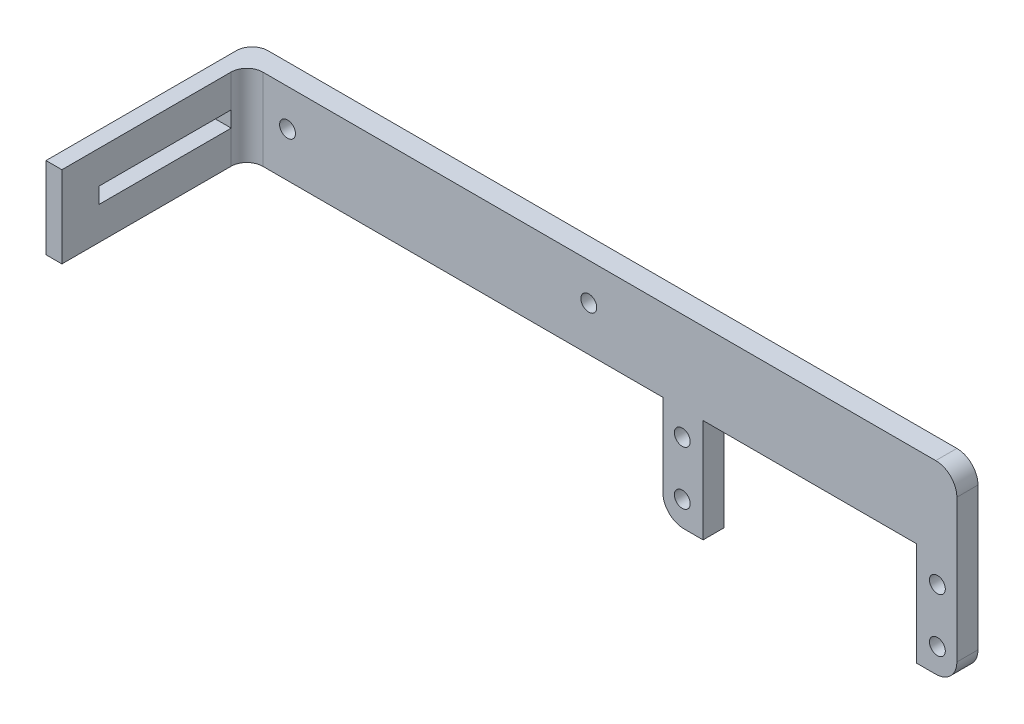
ISO-10303-21;
HEADER;
FILE_DESCRIPTION(('STEP AP214'),'2;1');
FILE_NAME('part.step','',(''),(''),'','','');
FILE_SCHEMA(('AUTOMOTIVE_DESIGN { 1 0 10303 214 1 1 1 1 }'));
ENDSEC;
DATA;
#1=APPLICATION_CONTEXT('core data for automotive mechanical design processes');
#2=APPLICATION_PROTOCOL_DEFINITION('international standard','automotive_design',2000,#1);
#3=PRODUCT_CONTEXT('',#1,'mechanical');
#4=PRODUCT('Part','Part','',(#3));
#5=PRODUCT_RELATED_PRODUCT_CATEGORY('part','',(#4));
#6=PRODUCT_DEFINITION_FORMATION('','',#4);
#7=PRODUCT_DEFINITION_CONTEXT('part definition',#1,'design');
#8=PRODUCT_DEFINITION('design','',#6,#7);
#9=PRODUCT_DEFINITION_SHAPE('','',#8);
#10=(LENGTH_UNIT() NAMED_UNIT(*) SI_UNIT(.MILLI.,.METRE.));
#11=(NAMED_UNIT(*) PLANE_ANGLE_UNIT() SI_UNIT($,.RADIAN.));
#12=(NAMED_UNIT(*) SI_UNIT($,.STERADIAN.) SOLID_ANGLE_UNIT());
#13=UNCERTAINTY_MEASURE_WITH_UNIT(LENGTH_MEASURE(1.E-05),#10,'distance_accuracy_value','');
#14=(GEOMETRIC_REPRESENTATION_CONTEXT(3) GLOBAL_UNCERTAINTY_ASSIGNED_CONTEXT((#13)) GLOBAL_UNIT_ASSIGNED_CONTEXT((#10,
#11,#12)) REPRESENTATION_CONTEXT('',''));
#15=CARTESIAN_POINT('',(0.,0.,0.));
#16=DIRECTION('',(0.,0.,1.));
#17=DIRECTION('',(1.,0.,0.));
#18=AXIS2_PLACEMENT_3D('',#15,#16,#17);
#19=CARTESIAN_POINT('',(0.,32.3655253772291,4.));
#20=DIRECTION('',(0.,1.,0.));
#21=DIRECTION('',(0.,0.,1.));
#22=AXIS2_PLACEMENT_3D('',#19,#20,#21);
#23=PLANE('',#22);
#24=DIRECTION('',(1.,0.,0.));
#25=VECTOR('',#24,1.);
#26=CARTESIAN_POINT('',(0.,32.3655253772291,0.));
#27=LINE('',#26,#25);
#28=CARTESIAN_POINT('',(-153.391060609872,32.3655253772291,0.));
#29=VERTEX_POINT('',#28);
#30=CARTESIAN_POINT('',(-23.0750939681456,32.3655253772291,0.));
#31=VERTEX_POINT('',#30);
#32=EDGE_CURVE('E266',#29,#31,#27,.T.);
#33=ORIENTED_EDGE('',*,*,#32,.F.);
#34=CARTESIAN_POINT('',(-153.391060609872,32.3655253772291,3.));
#35=DIRECTION('',(0.,1.,0.));
#36=DIRECTION('',(0.,0.,1.));
#37=AXIS2_PLACEMENT_3D('',#34,#35,#36);
#38=CIRCLE('',#37,3.);
#39=CARTESIAN_POINT('',(-156.391060609872,32.3655253772291,3.));
#40=VERTEX_POINT('',#39);
#41=EDGE_CURVE('E374',#29,#40,#38,.T.);
#42=ORIENTED_EDGE('',*,*,#41,.T.);
#43=DIRECTION('',(0.,0.,-1.));
#44=VECTOR('',#43,1.);
#45=CARTESIAN_POINT('',(-156.391060609872,32.3655253772291,4.));
#46=LINE('',#45,#44);
#47=CARTESIAN_POINT('',(-156.391060609872,32.3655253772291,39.));
#48=VERTEX_POINT('',#47);
#49=EDGE_CURVE('E328',#48,#40,#46,.T.);
#50=ORIENTED_EDGE('',*,*,#49,.F.);
#51=DIRECTION('',(-1.,0.,0.));
#52=VECTOR('',#51,1.);
#53=CARTESIAN_POINT('',(-156.391060609872,32.3655253772291,39.));
#54=LINE('',#53,#52);
#55=CARTESIAN_POINT('',(-153.384544729697,32.3655253772291,39.));
#56=VERTEX_POINT('',#55);
#57=EDGE_CURVE('E224',#56,#48,#54,.T.);
#58=ORIENTED_EDGE('',*,*,#57,.F.);
#59=DIRECTION('',(0.,0.,-1.));
#60=VECTOR('',#59,1.);
#61=CARTESIAN_POINT('',(-153.384544729697,32.3655253772291,39.));
#62=LINE('',#61,#60);
#63=CARTESIAN_POINT('',(-153.384544729697,32.3655253772291,7.));
#64=VERTEX_POINT('',#63);
#65=EDGE_CURVE('E227',#56,#64,#62,.T.);
#66=ORIENTED_EDGE('',*,*,#65,.T.);
#67=CARTESIAN_POINT('',(-150.384544729697,32.3655253772291,7.));
#68=DIRECTION('',(0.,1.,0.));
#69=DIRECTION('',(0.,0.,1.));
#70=AXIS2_PLACEMENT_3D('',#67,#68,#69);
#71=CIRCLE('',#70,3.);
#72=CARTESIAN_POINT('',(-150.384544729697,32.3655253772291,4.));
#73=VERTEX_POINT('',#72);
#74=EDGE_CURVE('E363',#64,#73,#71,.F.);
#75=ORIENTED_EDGE('',*,*,#74,.T.);
#76=DIRECTION('',(1.,0.,0.));
#77=VECTOR('',#76,1.);
#78=CARTESIAN_POINT('',(0.,32.3655253772291,4.));
#79=LINE('',#78,#77);
#80=CARTESIAN_POINT('',(-23.0750939681456,32.3655253772291,4.));
#81=VERTEX_POINT('',#80);
#82=EDGE_CURVE('E269',#73,#81,#79,.T.);
#83=ORIENTED_EDGE('',*,*,#82,.T.);
#84=DIRECTION('',(0.,0.,-1.));
#85=VECTOR('',#84,1.);
#86=CARTESIAN_POINT('',(-23.0750939681456,32.3655253772291,0.));
#87=LINE('',#86,#85);
#88=EDGE_CURVE('E331',#81,#31,#87,.T.);
#89=ORIENTED_EDGE('',*,*,#88,.T.);
#90=EDGE_LOOP('',(#33,#42,#50,#58,#66,#75,#83,#89));
#91=FACE_BOUND('',#90,.T.);
#92=ADVANCED_FACE('F35',(#91),#23,.T.);
#93=CARTESIAN_POINT('',(-156.391060609872,0.,4.));
#94=DIRECTION('',(1.,0.,0.));
#95=DIRECTION('',(0.,0.,-1.));
#96=AXIS2_PLACEMENT_3D('',#93,#94,#95);
#97=PLANE('',#96);
#98=DIRECTION('',(0.,0.,-1.));
#99=VECTOR('',#98,1.);
#100=CARTESIAN_POINT('',(-156.391060609872,23.1655253772291,4.));
#101=LINE('',#100,#99);
#102=CARTESIAN_POINT('',(-156.391060609872,23.1655253772291,31.96699669967));
#103=VERTEX_POINT('',#102);
#104=CARTESIAN_POINT('',(-156.391060609872,23.1655253772291,6.96699669966997));
#105=VERTEX_POINT('',#104);
#106=EDGE_CURVE('E193',#103,#105,#101,.T.);
#107=ORIENTED_EDGE('',*,*,#106,.T.);
#108=DIRECTION('',(0.,1.,0.));
#109=VECTOR('',#108,1.);
#110=CARTESIAN_POINT('',(-156.391060609872,0.,6.96699669966997));
#111=LINE('',#110,#109);
#112=CARTESIAN_POINT('',(-156.391060609872,26.1655253772291,6.96699669966997));
#113=VERTEX_POINT('',#112);
#114=EDGE_CURVE('E212',#105,#113,#111,.T.);
#115=ORIENTED_EDGE('',*,*,#114,.T.);
#116=DIRECTION('',(0.,0.,1.));
#117=VECTOR('',#116,1.);
#118=CARTESIAN_POINT('',(-156.391060609872,26.1655253772291,4.));
#119=LINE('',#118,#117);
#120=CARTESIAN_POINT('',(-156.391060609872,26.1655253772291,31.96699669967));
#121=VERTEX_POINT('',#120);
#122=EDGE_CURVE('E209',#113,#121,#119,.T.);
#123=ORIENTED_EDGE('',*,*,#122,.T.);
#124=DIRECTION('',(0.,-1.,0.));
#125=VECTOR('',#124,1.);
#126=CARTESIAN_POINT('',(-156.391060609872,0.,31.96699669967));
#127=LINE('',#126,#125);
#128=EDGE_CURVE('E215',#121,#103,#127,.T.);
#129=ORIENTED_EDGE('',*,*,#128,.T.);
#130=EDGE_LOOP('',(#107,#115,#123,#129));
#131=FACE_BOUND('',#130,.T.);
#132=ORIENTED_EDGE('',*,*,#49,.T.);
#133=DIRECTION('',(0.,-1.,0.));
#134=VECTOR('',#133,1.);
#135=CARTESIAN_POINT('',(-156.391060609872,0.,3.));
#136=LINE('',#135,#134);
#137=CARTESIAN_POINT('',(-156.391060609872,16.9235253772291,3.));
#138=VERTEX_POINT('',#137);
#139=EDGE_CURVE('E367',#40,#138,#136,.T.);
#140=ORIENTED_EDGE('',*,*,#139,.T.);
#141=DIRECTION('',(0.,0.,-1.));
#142=VECTOR('',#141,1.);
#143=CARTESIAN_POINT('',(-156.391060609872,16.9235253772291,4.));
#144=LINE('',#143,#142);
#145=CARTESIAN_POINT('',(-156.391060609872,16.9235253772291,39.));
#146=VERTEX_POINT('',#145);
#147=EDGE_CURVE('E325',#146,#138,#144,.T.);
#148=ORIENTED_EDGE('',*,*,#147,.F.);
#149=DIRECTION('',(0.,-1.,0.));
#150=VECTOR('',#149,1.);
#151=CARTESIAN_POINT('',(-156.391060609872,32.3655253772291,39.));
#152=LINE('',#151,#150);
#153=EDGE_CURVE('E217',#48,#146,#152,.T.);
#154=ORIENTED_EDGE('',*,*,#153,.F.);
#155=EDGE_LOOP('',(#132,#140,#148,#154));
#156=FACE_BOUND('',#155,.T.);
#157=ADVANCED_FACE('F400',(#131,#156),#97,.F.);
#158=CARTESIAN_POINT('',(0.,16.9235253772291,4.));
#159=DIRECTION('',(0.,1.,0.));
#160=DIRECTION('',(0.,0.,1.));
#161=AXIS2_PLACEMENT_3D('',#158,#159,#160);
#162=PLANE('',#161);
#163=ORIENTED_EDGE('',*,*,#147,.T.);
#164=CARTESIAN_POINT('',(-153.391060609872,16.9235253772291,3.));
#165=DIRECTION('',(0.,1.,0.));
#166=DIRECTION('',(0.,0.,1.));
#167=AXIS2_PLACEMENT_3D('',#164,#165,#166);
#168=CIRCLE('',#167,3.);
#169=CARTESIAN_POINT('',(-153.391060609872,16.9235253772291,0.));
#170=VERTEX_POINT('',#169);
#171=EDGE_CURVE('E370',#138,#170,#168,.F.);
#172=ORIENTED_EDGE('',*,*,#171,.T.);
#173=DIRECTION('',(1.,0.,0.));
#174=VECTOR('',#173,1.);
#175=CARTESIAN_POINT('',(0.,16.9235253772291,0.));
#176=LINE('',#175,#174);
#177=CARTESIAN_POINT('',(-74.7010939681456,16.9235253772291,0.));
#178=VERTEX_POINT('',#177);
#179=EDGE_CURVE('E293',#170,#178,#176,.T.);
#180=ORIENTED_EDGE('',*,*,#179,.T.);
#181=DIRECTION('',(0.,0.,-1.));
#182=VECTOR('',#181,1.);
#183=CARTESIAN_POINT('',(-74.7010939681456,16.9235253772291,4.));
#184=LINE('',#183,#182);
#185=CARTESIAN_POINT('',(-74.7010939681456,16.9235253772291,4.));
#186=VERTEX_POINT('',#185);
#187=EDGE_CURVE('E322',#186,#178,#184,.T.);
#188=ORIENTED_EDGE('',*,*,#187,.F.);
#189=DIRECTION('',(1.,0.,0.));
#190=VECTOR('',#189,1.);
#191=CARTESIAN_POINT('',(0.,16.9235253772291,4.));
#192=LINE('',#191,#190);
#193=CARTESIAN_POINT('',(-150.384544729697,16.9235253772291,4.));
#194=VERTEX_POINT('',#193);
#195=EDGE_CURVE('E271',#194,#186,#192,.T.);
#196=ORIENTED_EDGE('',*,*,#195,.F.);
#197=CARTESIAN_POINT('',(-150.384544729697,16.9235253772291,7.));
#198=DIRECTION('',(0.,1.,0.));
#199=DIRECTION('',(0.,0.,1.));
#200=AXIS2_PLACEMENT_3D('',#197,#198,#199);
#201=CIRCLE('',#200,3.);
#202=CARTESIAN_POINT('',(-153.384544729697,16.9235253772291,7.));
#203=VERTEX_POINT('',#202);
#204=EDGE_CURVE('E365',#194,#203,#201,.T.);
#205=ORIENTED_EDGE('',*,*,#204,.T.);
#206=DIRECTION('',(0.,0.,-1.));
#207=VECTOR('',#206,1.);
#208=CARTESIAN_POINT('',(-153.384544729697,16.9235253772291,39.));
#209=LINE('',#208,#207);
#210=CARTESIAN_POINT('',(-153.384544729697,16.9235253772291,39.));
#211=VERTEX_POINT('',#210);
#212=EDGE_CURVE('E230',#211,#203,#209,.T.);
#213=ORIENTED_EDGE('',*,*,#212,.F.);
#214=DIRECTION('',(1.,0.,0.));
#215=VECTOR('',#214,1.);
#216=CARTESIAN_POINT('',(-156.391060609872,16.9235253772291,39.));
#217=LINE('',#216,#215);
#218=EDGE_CURVE('E220',#146,#211,#217,.T.);
#219=ORIENTED_EDGE('',*,*,#218,.F.);
#220=EDGE_LOOP('',(#163,#172,#180,#188,#196,#205,#213,#219));
#221=FACE_BOUND('',#220,.T.);
#222=ADVANCED_FACE('F405',(#221),#162,.F.);
#223=CARTESIAN_POINT('',(-74.7010939681456,0.,4.));
#224=DIRECTION('',(1.,0.,0.));
#225=DIRECTION('',(0.,0.,-1.));
#226=AXIS2_PLACEMENT_3D('',#223,#224,#225);
#227=PLANE('',#226);
#228=DIRECTION('',(0.,-1.,0.));
#229=VECTOR('',#228,1.);
#230=CARTESIAN_POINT('',(-74.7010939681456,0.,0.));
#231=LINE('',#230,#229);
#232=CARTESIAN_POINT('',(-74.7010939681456,1.36552537722908,0.));
#233=VERTEX_POINT('',#232);
#234=EDGE_CURVE('E295',#178,#233,#231,.T.);
#235=ORIENTED_EDGE('',*,*,#234,.T.);
#236=DIRECTION('',(0.,0.,-1.));
#237=VECTOR('',#236,1.);
#238=CARTESIAN_POINT('',(-74.7010939681456,1.36552537722908,4.));
#239=LINE('',#238,#237);
#240=CARTESIAN_POINT('',(-74.7010939681456,1.36552537722908,4.));
#241=VERTEX_POINT('',#240);
#242=EDGE_CURVE('E355',#233,#241,#239,.F.);
#243=ORIENTED_EDGE('',*,*,#242,.T.);
#244=DIRECTION('',(0.,-1.,0.));
#245=VECTOR('',#244,1.);
#246=CARTESIAN_POINT('',(-74.7010939681456,0.,4.));
#247=LINE('',#246,#245);
#248=EDGE_CURVE('E274',#186,#241,#247,.T.);
#249=ORIENTED_EDGE('',*,*,#248,.F.);
#250=ORIENTED_EDGE('',*,*,#187,.T.);
#251=EDGE_LOOP('',(#235,#243,#249,#250));
#252=FACE_BOUND('',#251,.T.);
#253=ADVANCED_FACE('F417',(#252),#227,.F.);
#254=CARTESIAN_POINT('',(0.,-2.63447462277092,4.));
#255=DIRECTION('',(0.,1.,0.));
#256=DIRECTION('',(0.,0.,1.));
#257=AXIS2_PLACEMENT_3D('',#254,#255,#256);
#258=PLANE('',#257);
#259=DIRECTION('',(1.,0.,0.));
#260=VECTOR('',#259,1.);
#261=CARTESIAN_POINT('',(0.,-2.63447462277092,4.));
#262=LINE('',#261,#260);
#263=CARTESIAN_POINT('',(-70.7010939681456,-2.63447462277092,4.));
#264=VERTEX_POINT('',#263);
#265=CARTESIAN_POINT('',(-67.0810939681456,-2.63447462277092,4.));
#266=VERTEX_POINT('',#265);
#267=EDGE_CURVE('E277',#264,#266,#262,.T.);
#268=ORIENTED_EDGE('',*,*,#267,.F.);
#269=DIRECTION('',(0.,0.,-1.));
#270=VECTOR('',#269,1.);
#271=CARTESIAN_POINT('',(-70.7010939681456,-2.63447462277092,4.));
#272=LINE('',#271,#270);
#273=CARTESIAN_POINT('',(-70.7010939681456,-2.63447462277092,0.));
#274=VERTEX_POINT('',#273);
#275=EDGE_CURVE('E352',#264,#274,#272,.T.);
#276=ORIENTED_EDGE('',*,*,#275,.T.);
#277=DIRECTION('',(1.,0.,0.));
#278=VECTOR('',#277,1.);
#279=CARTESIAN_POINT('',(0.,-2.63447462277092,0.));
#280=LINE('',#279,#278);
#281=CARTESIAN_POINT('',(-67.0810939681456,-2.63447462277092,0.));
#282=VERTEX_POINT('',#281);
#283=EDGE_CURVE('E298',#274,#282,#280,.T.);
#284=ORIENTED_EDGE('',*,*,#283,.T.);
#285=DIRECTION('',(0.,0.,-1.));
#286=VECTOR('',#285,1.);
#287=CARTESIAN_POINT('',(-67.0810939681456,-2.63447462277092,4.));
#288=LINE('',#287,#286);
#289=EDGE_CURVE('E319',#266,#282,#288,.T.);
#290=ORIENTED_EDGE('',*,*,#289,.F.);
#291=EDGE_LOOP('',(#268,#276,#284,#290));
#292=FACE_BOUND('',#291,.T.);
#293=ADVANCED_FACE('F498',(#292),#258,.F.);
#294=CARTESIAN_POINT('',(-67.0810939681456,0.,4.));
#295=DIRECTION('',(-1.,0.,0.));
#296=DIRECTION('',(0.,0.,1.));
#297=AXIS2_PLACEMENT_3D('',#294,#295,#296);
#298=PLANE('',#297);
#299=DIRECTION('',(0.,1.,0.));
#300=VECTOR('',#299,1.);
#301=CARTESIAN_POINT('',(-67.0810939681456,0.,0.));
#302=LINE('',#301,#300);
#303=CARTESIAN_POINT('',(-67.0810939681456,16.9235253772291,0.));
#304=VERTEX_POINT('',#303);
#305=EDGE_CURVE('E300',#282,#304,#302,.T.);
#306=ORIENTED_EDGE('',*,*,#305,.T.);
#307=DIRECTION('',(0.,0.,-1.));
#308=VECTOR('',#307,1.);
#309=CARTESIAN_POINT('',(-67.0810939681456,16.9235253772291,4.));
#310=LINE('',#309,#308);
#311=CARTESIAN_POINT('',(-67.0810939681456,16.9235253772291,4.));
#312=VERTEX_POINT('',#311);
#313=EDGE_CURVE('E316',#312,#304,#310,.T.);
#314=ORIENTED_EDGE('',*,*,#313,.F.);
#315=DIRECTION('',(0.,1.,0.));
#316=VECTOR('',#315,1.);
#317=CARTESIAN_POINT('',(-67.0810939681456,0.,4.));
#318=LINE('',#317,#316);
#319=EDGE_CURVE('E279',#266,#312,#318,.T.);
#320=ORIENTED_EDGE('',*,*,#319,.F.);
#321=ORIENTED_EDGE('',*,*,#289,.T.);
#322=EDGE_LOOP('',(#306,#314,#320,#321));
#323=FACE_BOUND('',#322,.T.);
#324=ADVANCED_FACE('F494',(#323),#298,.F.);
#325=CARTESIAN_POINT('',(0.,16.9235253772291,4.));
#326=DIRECTION('',(0.,1.,0.));
#327=DIRECTION('',(0.,0.,1.));
#328=AXIS2_PLACEMENT_3D('',#325,#326,#327);
#329=PLANE('',#328);
#330=DIRECTION('',(1.,0.,0.));
#331=VECTOR('',#330,1.);
#332=CARTESIAN_POINT('',(0.,16.9235253772291,0.));
#333=LINE('',#332,#331);
#334=CARTESIAN_POINT('',(-26.6950939681456,16.9235253772291,0.));
#335=VERTEX_POINT('',#334);
#336=EDGE_CURVE('E302',#304,#335,#333,.T.);
#337=ORIENTED_EDGE('',*,*,#336,.T.);
#338=DIRECTION('',(0.,0.,-1.));
#339=VECTOR('',#338,1.);
#340=CARTESIAN_POINT('',(-26.6950939681456,16.9235253772291,4.));
#341=LINE('',#340,#339);
#342=CARTESIAN_POINT('',(-26.6950939681456,16.9235253772291,4.));
#343=VERTEX_POINT('',#342);
#344=EDGE_CURVE('E313',#343,#335,#341,.T.);
#345=ORIENTED_EDGE('',*,*,#344,.F.);
#346=DIRECTION('',(1.,0.,0.));
#347=VECTOR('',#346,1.);
#348=CARTESIAN_POINT('',(0.,16.9235253772291,4.));
#349=LINE('',#348,#347);
#350=EDGE_CURVE('E281',#312,#343,#349,.T.);
#351=ORIENTED_EDGE('',*,*,#350,.F.);
#352=ORIENTED_EDGE('',*,*,#313,.T.);
#353=EDGE_LOOP('',(#337,#345,#351,#352));
#354=FACE_BOUND('',#353,.T.);
#355=ADVANCED_FACE('F490',(#354),#329,.F.);
#356=CARTESIAN_POINT('',(-26.6950939681456,0.,4.));
#357=DIRECTION('',(1.,0.,0.));
#358=DIRECTION('',(0.,0.,-1.));
#359=AXIS2_PLACEMENT_3D('',#356,#357,#358);
#360=PLANE('',#359);
#361=DIRECTION('',(0.,-1.,0.));
#362=VECTOR('',#361,1.);
#363=CARTESIAN_POINT('',(-26.6950939681456,0.,0.));
#364=LINE('',#363,#362);
#365=CARTESIAN_POINT('',(-26.6950939681456,-2.63447462277092,0.));
#366=VERTEX_POINT('',#365);
#367=EDGE_CURVE('E304',#335,#366,#364,.T.);
#368=ORIENTED_EDGE('',*,*,#367,.T.);
#369=DIRECTION('',(0.,0.,-1.));
#370=VECTOR('',#369,1.);
#371=CARTESIAN_POINT('',(-26.6950939681456,-2.63447462277092,4.));
#372=LINE('',#371,#370);
#373=CARTESIAN_POINT('',(-26.6950939681456,-2.63447462277092,4.));
#374=VERTEX_POINT('',#373);
#375=EDGE_CURVE('E291',#374,#366,#372,.T.);
#376=ORIENTED_EDGE('',*,*,#375,.F.);
#377=DIRECTION('',(0.,-1.,0.));
#378=VECTOR('',#377,1.);
#379=CARTESIAN_POINT('',(-26.6950939681456,0.,4.));
#380=LINE('',#379,#378);
#381=EDGE_CURVE('E283',#343,#374,#380,.T.);
#382=ORIENTED_EDGE('',*,*,#381,.F.);
#383=ORIENTED_EDGE('',*,*,#344,.T.);
#384=EDGE_LOOP('',(#368,#376,#382,#383));
#385=FACE_BOUND('',#384,.T.);
#386=ADVANCED_FACE('F486',(#385),#360,.F.);
#387=CARTESIAN_POINT('',(0.,-2.63447462277092,4.));
#388=DIRECTION('',(0.,1.,0.));
#389=DIRECTION('',(0.,0.,1.));
#390=AXIS2_PLACEMENT_3D('',#387,#388,#389);
#391=PLANE('',#390);
#392=DIRECTION('',(1.,0.,0.));
#393=VECTOR('',#392,1.);
#394=CARTESIAN_POINT('',(0.,-2.63447462277092,0.));
#395=LINE('',#394,#393);
#396=CARTESIAN_POINT('',(-23.0750939681456,-2.63447462277092,0.));
#397=VERTEX_POINT('',#396);
#398=EDGE_CURVE('E306',#366,#397,#395,.T.);
#399=ORIENTED_EDGE('',*,*,#398,.T.);
#400=DIRECTION('',(0.,0.,-1.));
#401=VECTOR('',#400,1.);
#402=CARTESIAN_POINT('',(-23.0750939681456,-2.63447462277092,4.));
#403=LINE('',#402,#401);
#404=CARTESIAN_POINT('',(-23.0750939681456,-2.63447462277092,4.));
#405=VERTEX_POINT('',#404);
#406=EDGE_CURVE('E357',#397,#405,#403,.F.);
#407=ORIENTED_EDGE('',*,*,#406,.T.);
#408=DIRECTION('',(1.,0.,0.));
#409=VECTOR('',#408,1.);
#410=CARTESIAN_POINT('',(0.,-2.63447462277092,4.));
#411=LINE('',#410,#409);
#412=EDGE_CURVE('E285',#374,#405,#411,.T.);
#413=ORIENTED_EDGE('',*,*,#412,.F.);
#414=ORIENTED_EDGE('',*,*,#375,.T.);
#415=EDGE_LOOP('',(#399,#407,#413,#414));
#416=FACE_BOUND('',#415,.T.);
#417=ADVANCED_FACE('F482',(#416),#391,.F.);
#418=CARTESIAN_POINT('',(-19.0750939681456,0.,4.));
#419=DIRECTION('',(-1.,0.,0.));
#420=DIRECTION('',(0.,0.,1.));
#421=AXIS2_PLACEMENT_3D('',#418,#419,#420);
#422=PLANE('',#421);
#423=DIRECTION('',(0.,1.,0.));
#424=VECTOR('',#423,1.);
#425=CARTESIAN_POINT('',(-19.0750939681456,0.,0.));
#426=LINE('',#425,#424);
#427=CARTESIAN_POINT('',(-19.0750939681456,1.36552537722908,0.));
#428=VERTEX_POINT('',#427);
#429=CARTESIAN_POINT('',(-19.0750939681456,28.3655253772291,0.));
#430=VERTEX_POINT('',#429);
#431=EDGE_CURVE('E272',#428,#430,#426,.T.);
#432=ORIENTED_EDGE('',*,*,#431,.T.);
#433=DIRECTION('',(0.,0.,-1.));
#434=VECTOR('',#433,1.);
#435=CARTESIAN_POINT('',(-19.0750939681456,28.3655253772291,4.));
#436=LINE('',#435,#434);
#437=CARTESIAN_POINT('',(-19.0750939681456,28.3655253772291,4.));
#438=VERTEX_POINT('',#437);
#439=EDGE_CURVE('E343',#430,#438,#436,.F.);
#440=ORIENTED_EDGE('',*,*,#439,.T.);
#441=DIRECTION('',(0.,1.,0.));
#442=VECTOR('',#441,1.);
#443=CARTESIAN_POINT('',(-19.0750939681456,0.,4.));
#444=LINE('',#443,#442);
#445=CARTESIAN_POINT('',(-19.0750939681456,1.36552537722908,4.));
#446=VERTEX_POINT('',#445);
#447=EDGE_CURVE('E288',#446,#438,#444,.T.);
#448=ORIENTED_EDGE('',*,*,#447,.F.);
#449=DIRECTION('',(0.,0.,-1.));
#450=VECTOR('',#449,1.);
#451=CARTESIAN_POINT('',(-19.0750939681456,1.36552537722908,4.));
#452=LINE('',#451,#450);
#453=EDGE_CURVE('E340',#446,#428,#452,.T.);
#454=ORIENTED_EDGE('',*,*,#453,.T.);
#455=EDGE_LOOP('',(#432,#440,#448,#454));
#456=FACE_BOUND('',#455,.T.);
#457=ADVANCED_FACE('F475',(#456),#422,.F.);
#458=CARTESIAN_POINT('',(0.,0.,4.));
#459=DIRECTION('',(0.,0.,1.));
#460=DIRECTION('',(1.,0.,0.));
#461=AXIS2_PLACEMENT_3D('',#458,#459,#460);
#462=PLANE('',#461);
#463=ORIENTED_EDGE('',*,*,#82,.F.);
#464=DIRECTION('',(0.,1.,0.));
#465=VECTOR('',#464,1.);
#466=CARTESIAN_POINT('',(-150.384544729697,0.,4.));
#467=LINE('',#466,#465);
#468=EDGE_CURVE('E361',#73,#194,#467,.F.);
#469=ORIENTED_EDGE('',*,*,#468,.T.);
#470=ORIENTED_EDGE('',*,*,#195,.T.);
#471=ORIENTED_EDGE('',*,*,#248,.T.);
#472=CARTESIAN_POINT('',(-70.7010939681456,1.36552537722908,4.));
#473=DIRECTION('',(0.,0.,1.));
#474=DIRECTION('',(1.,0.,0.));
#475=AXIS2_PLACEMENT_3D('',#472,#473,#474);
#476=CIRCLE('',#475,4.);
#477=EDGE_CURVE('E347',#241,#264,#476,.T.);
#478=ORIENTED_EDGE('',*,*,#477,.T.);
#479=ORIENTED_EDGE('',*,*,#267,.T.);
#480=ORIENTED_EDGE('',*,*,#319,.T.);
#481=ORIENTED_EDGE('',*,*,#350,.T.);
#482=ORIENTED_EDGE('',*,*,#381,.T.);
#483=ORIENTED_EDGE('',*,*,#412,.T.);
#484=CARTESIAN_POINT('',(-23.0750939681456,1.36552537722908,4.));
#485=DIRECTION('',(0.,0.,1.));
#486=DIRECTION('',(1.,0.,0.));
#487=AXIS2_PLACEMENT_3D('',#484,#485,#486);
#488=CIRCLE('',#487,4.);
#489=EDGE_CURVE('E345',#405,#446,#488,.T.);
#490=ORIENTED_EDGE('',*,*,#489,.T.);
#491=ORIENTED_EDGE('',*,*,#447,.T.);
#492=CARTESIAN_POINT('',(-23.0750939681456,28.3655253772291,4.));
#493=DIRECTION('',(0.,0.,1.));
#494=DIRECTION('',(1.,0.,0.));
#495=AXIS2_PLACEMENT_3D('',#492,#493,#494);
#496=CIRCLE('',#495,4.);
#497=EDGE_CURVE('E349',#438,#81,#496,.T.);
#498=ORIENTED_EDGE('',*,*,#497,.T.);
#499=EDGE_LOOP('',(#463,#469,#470,#471,#478,#479,#480,#481,#482,#483,#490,#491,#498));
#500=FACE_BOUND('',#499,.T.);
#501=CARTESIAN_POINT('',(-88.7010939681456,25.3655253772291,4.));
#502=DIRECTION('',(0.,0.,1.));
#503=DIRECTION('',(1.,0.,0.));
#504=AXIS2_PLACEMENT_3D('',#501,#502,#503);
#505=CIRCLE('',#504,1.5);
#506=CARTESIAN_POINT('',(-87.2010939681456,25.3655253772291,4.));
#507=VERTEX_POINT('',#506);
#508=EDGE_CURVE('E233',#507,#507,#505,.T.);
#509=ORIENTED_EDGE('',*,*,#508,.F.);
#510=EDGE_LOOP('',(#509));
#511=FACE_BOUND('',#510,.T.);
#512=CARTESIAN_POINT('',(-145.701093968146,25.3655253772291,4.));
#513=DIRECTION('',(0.,0.,1.));
#514=DIRECTION('',(1.,0.,0.));
#515=AXIS2_PLACEMENT_3D('',#512,#513,#514);
#516=CIRCLE('',#515,1.5);
#517=CARTESIAN_POINT('',(-144.201093968146,25.3655253772291,4.));
#518=VERTEX_POINT('',#517);
#519=EDGE_CURVE('E236',#518,#518,#516,.T.);
#520=ORIENTED_EDGE('',*,*,#519,.F.);
#521=EDGE_LOOP('',(#520));
#522=FACE_BOUND('',#521,.T.);
#523=CARTESIAN_POINT('',(-71.0180939681455,2.06452537722908,4.));
#524=DIRECTION('',(0.,0.,1.));
#525=DIRECTION('',(1.,0.,0.));
#526=AXIS2_PLACEMENT_3D('',#523,#524,#525);
#527=CIRCLE('',#526,1.5);
#528=CARTESIAN_POINT('',(-69.5180939681455,2.06452537722908,4.));
#529=VERTEX_POINT('',#528);
#530=EDGE_CURVE('E242',#529,#529,#527,.T.);
#531=ORIENTED_EDGE('',*,*,#530,.F.);
#532=EDGE_LOOP('',(#531));
#533=FACE_BOUND('',#532,.T.);
#534=CARTESIAN_POINT('',(-22.7580939681455,2.06452537722908,4.));
#535=DIRECTION('',(0.,0.,1.));
#536=DIRECTION('',(1.,0.,0.));
#537=AXIS2_PLACEMENT_3D('',#534,#535,#536);
#538=CIRCLE('',#537,1.5);
#539=CARTESIAN_POINT('',(-21.2580939681455,2.06452537722908,4.));
#540=VERTEX_POINT('',#539);
#541=EDGE_CURVE('E248',#540,#540,#538,.T.);
#542=ORIENTED_EDGE('',*,*,#541,.F.);
#543=EDGE_LOOP('',(#542));
#544=FACE_BOUND('',#543,.T.);
#545=CARTESIAN_POINT('',(-22.7580939681456,12.2245253772291,4.));
#546=DIRECTION('',(0.,0.,1.));
#547=DIRECTION('',(1.,0.,0.));
#548=AXIS2_PLACEMENT_3D('',#545,#546,#547);
#549=CIRCLE('',#548,1.5);
#550=CARTESIAN_POINT('',(-21.2580939681456,12.2245253772291,4.));
#551=VERTEX_POINT('',#550);
#552=EDGE_CURVE('E254',#551,#551,#549,.T.);
#553=ORIENTED_EDGE('',*,*,#552,.F.);
#554=EDGE_LOOP('',(#553));
#555=FACE_BOUND('',#554,.T.);
#556=CARTESIAN_POINT('',(-71.0180939681456,12.2245253772291,4.));
#557=DIRECTION('',(0.,0.,1.));
#558=DIRECTION('',(1.,0.,0.));
#559=AXIS2_PLACEMENT_3D('',#556,#557,#558);
#560=CIRCLE('',#559,1.5);
#561=CARTESIAN_POINT('',(-69.5180939681456,12.2245253772291,4.));
#562=VERTEX_POINT('',#561);
#563=EDGE_CURVE('E260',#562,#562,#560,.T.);
#564=ORIENTED_EDGE('',*,*,#563,.F.);
#565=EDGE_LOOP('',(#564));
#566=FACE_BOUND('',#565,.T.);
#567=ADVANCED_FACE('F472',(#500,#511,#522,#533,#544,#555,#566),#462,.T.);
#568=CARTESIAN_POINT('',(0.,0.,0.));
#569=DIRECTION('',(0.,0.,1.));
#570=DIRECTION('',(1.,0.,0.));
#571=AXIS2_PLACEMENT_3D('',#568,#569,#570);
#572=PLANE('',#571);
#573=CARTESIAN_POINT('',(-88.7010939681456,25.3655253772291,0.));
#574=DIRECTION('',(0.,0.,1.));
#575=DIRECTION('',(1.,0.,0.));
#576=AXIS2_PLACEMENT_3D('',#573,#574,#575);
#577=CIRCLE('',#576,1.5);
#578=CARTESIAN_POINT('',(-87.2010939681456,25.3655253772291,0.));
#579=VERTEX_POINT('',#578);
#580=EDGE_CURVE('E232',#579,#579,#577,.T.);
#581=ORIENTED_EDGE('',*,*,#580,.T.);
#582=EDGE_LOOP('',(#581));
#583=FACE_BOUND('',#582,.T.);
#584=CARTESIAN_POINT('',(-145.701093968146,25.3655253772291,0.));
#585=DIRECTION('',(0.,0.,1.));
#586=DIRECTION('',(1.,0.,0.));
#587=AXIS2_PLACEMENT_3D('',#584,#585,#586);
#588=CIRCLE('',#587,1.5);
#589=CARTESIAN_POINT('',(-144.201093968146,25.3655253772291,0.));
#590=VERTEX_POINT('',#589);
#591=EDGE_CURVE('E239',#590,#590,#588,.T.);
#592=ORIENTED_EDGE('',*,*,#591,.T.);
#593=EDGE_LOOP('',(#592));
#594=FACE_BOUND('',#593,.T.);
#595=CARTESIAN_POINT('',(-71.0180939681455,2.06452537722908,0.));
#596=DIRECTION('',(0.,0.,1.));
#597=DIRECTION('',(1.,0.,0.));
#598=AXIS2_PLACEMENT_3D('',#595,#596,#597);
#599=CIRCLE('',#598,1.5);
#600=CARTESIAN_POINT('',(-69.5180939681455,2.06452537722908,0.));
#601=VERTEX_POINT('',#600);
#602=EDGE_CURVE('E245',#601,#601,#599,.T.);
#603=ORIENTED_EDGE('',*,*,#602,.T.);
#604=EDGE_LOOP('',(#603));
#605=FACE_BOUND('',#604,.T.);
#606=CARTESIAN_POINT('',(-22.7580939681455,2.06452537722908,0.));
#607=DIRECTION('',(0.,0.,1.));
#608=DIRECTION('',(1.,0.,0.));
#609=AXIS2_PLACEMENT_3D('',#606,#607,#608);
#610=CIRCLE('',#609,1.5);
#611=CARTESIAN_POINT('',(-21.2580939681455,2.06452537722908,0.));
#612=VERTEX_POINT('',#611);
#613=EDGE_CURVE('E251',#612,#612,#610,.T.);
#614=ORIENTED_EDGE('',*,*,#613,.T.);
#615=EDGE_LOOP('',(#614));
#616=FACE_BOUND('',#615,.T.);
#617=CARTESIAN_POINT('',(-22.7580939681456,12.2245253772291,0.));
#618=DIRECTION('',(0.,0.,1.));
#619=DIRECTION('',(1.,0.,0.));
#620=AXIS2_PLACEMENT_3D('',#617,#618,#619);
#621=CIRCLE('',#620,1.5);
#622=CARTESIAN_POINT('',(-21.2580939681456,12.2245253772291,0.));
#623=VERTEX_POINT('',#622);
#624=EDGE_CURVE('E257',#623,#623,#621,.T.);
#625=ORIENTED_EDGE('',*,*,#624,.T.);
#626=EDGE_LOOP('',(#625));
#627=FACE_BOUND('',#626,.T.);
#628=CARTESIAN_POINT('',(-71.0180939681456,12.2245253772291,0.));
#629=DIRECTION('',(0.,0.,1.));
#630=DIRECTION('',(1.,0.,0.));
#631=AXIS2_PLACEMENT_3D('',#628,#629,#630);
#632=CIRCLE('',#631,1.5);
#633=CARTESIAN_POINT('',(-69.5180939681456,12.2245253772291,0.));
#634=VERTEX_POINT('',#633);
#635=EDGE_CURVE('E263',#634,#634,#632,.T.);
#636=ORIENTED_EDGE('',*,*,#635,.T.);
#637=EDGE_LOOP('',(#636));
#638=FACE_BOUND('',#637,.T.);
#639=ORIENTED_EDGE('',*,*,#179,.F.);
#640=DIRECTION('',(0.,-1.,0.));
#641=VECTOR('',#640,1.);
#642=CARTESIAN_POINT('',(-153.391060609872,0.,0.));
#643=LINE('',#642,#641);
#644=EDGE_CURVE('E372',#170,#29,#643,.F.);
#645=ORIENTED_EDGE('',*,*,#644,.T.);
#646=ORIENTED_EDGE('',*,*,#32,.T.);
#647=CARTESIAN_POINT('',(-23.0750939681456,28.3655253772291,0.));
#648=DIRECTION('',(0.,0.,1.));
#649=DIRECTION('',(1.,0.,0.));
#650=AXIS2_PLACEMENT_3D('',#647,#648,#649);
#651=CIRCLE('',#650,4.);
#652=EDGE_CURVE('E338',#31,#430,#651,.F.);
#653=ORIENTED_EDGE('',*,*,#652,.T.);
#654=ORIENTED_EDGE('',*,*,#431,.F.);
#655=CARTESIAN_POINT('',(-23.0750939681456,1.36552537722908,0.));
#656=DIRECTION('',(0.,0.,1.));
#657=DIRECTION('',(1.,0.,0.));
#658=AXIS2_PLACEMENT_3D('',#655,#656,#657);
#659=CIRCLE('',#658,4.);
#660=EDGE_CURVE('E334',#428,#397,#659,.F.);
#661=ORIENTED_EDGE('',*,*,#660,.T.);
#662=ORIENTED_EDGE('',*,*,#398,.F.);
#663=ORIENTED_EDGE('',*,*,#367,.F.);
#664=ORIENTED_EDGE('',*,*,#336,.F.);
#665=ORIENTED_EDGE('',*,*,#305,.F.);
#666=ORIENTED_EDGE('',*,*,#283,.F.);
#667=CARTESIAN_POINT('',(-70.7010939681456,1.36552537722908,0.));
#668=DIRECTION('',(0.,0.,1.));
#669=DIRECTION('',(1.,0.,0.));
#670=AXIS2_PLACEMENT_3D('',#667,#668,#669);
#671=CIRCLE('',#670,4.);
#672=EDGE_CURVE('E336',#274,#233,#671,.F.);
#673=ORIENTED_EDGE('',*,*,#672,.T.);
#674=ORIENTED_EDGE('',*,*,#234,.F.);
#675=EDGE_LOOP('',(#639,#645,#646,#653,#654,#661,#662,#663,#664,#665,#666,#673,#674));
#676=FACE_BOUND('',#675,.T.);
#677=ADVANCED_FACE('F426',(#583,#594,#605,#616,#627,#638,#676),#572,.F.);
#678=CARTESIAN_POINT('',(-23.0750939681456,28.3655253772291,4.));
#679=DIRECTION('',(0.,0.,1.));
#680=DIRECTION('',(1.,0.,0.));
#681=AXIS2_PLACEMENT_3D('',#678,#679,#680);
#682=CYLINDRICAL_SURFACE('',#681,4.);
#683=ORIENTED_EDGE('',*,*,#497,.F.);
#684=ORIENTED_EDGE('',*,*,#439,.F.);
#685=ORIENTED_EDGE('',*,*,#652,.F.);
#686=ORIENTED_EDGE('',*,*,#88,.F.);
#687=EDGE_LOOP('',(#683,#684,#685,#686));
#688=FACE_BOUND('',#687,.T.);
#689=ADVANCED_FACE('F422',(#688),#682,.T.);
#690=CARTESIAN_POINT('',(-70.7010939681456,1.36552537722908,4.));
#691=DIRECTION('',(0.,0.,-1.));
#692=DIRECTION('',(-1.,0.,0.));
#693=AXIS2_PLACEMENT_3D('',#690,#691,#692);
#694=CYLINDRICAL_SURFACE('',#693,4.);
#695=ORIENTED_EDGE('',*,*,#477,.F.);
#696=ORIENTED_EDGE('',*,*,#242,.F.);
#697=ORIENTED_EDGE('',*,*,#672,.F.);
#698=ORIENTED_EDGE('',*,*,#275,.F.);
#699=EDGE_LOOP('',(#695,#696,#697,#698));
#700=FACE_BOUND('',#699,.T.);
#701=ADVANCED_FACE('F425',(#700),#694,.T.);
#702=CARTESIAN_POINT('',(-23.0750939681456,1.36552537722908,4.));
#703=DIRECTION('',(0.,0.,-1.));
#704=DIRECTION('',(-1.,0.,0.));
#705=AXIS2_PLACEMENT_3D('',#702,#703,#704);
#706=CYLINDRICAL_SURFACE('',#705,4.);
#707=ORIENTED_EDGE('',*,*,#489,.F.);
#708=ORIENTED_EDGE('',*,*,#406,.F.);
#709=ORIENTED_EDGE('',*,*,#660,.F.);
#710=ORIENTED_EDGE('',*,*,#453,.F.);
#711=EDGE_LOOP('',(#707,#708,#709,#710));
#712=FACE_BOUND('',#711,.T.);
#713=ADVANCED_FACE('F430',(#712),#706,.T.);
#714=CARTESIAN_POINT('',(-71.0180939681456,12.2245253772291,0.));
#715=DIRECTION('',(0.,0.,1.));
#716=DIRECTION('',(1.,0.,0.));
#717=AXIS2_PLACEMENT_3D('',#714,#715,#716);
#718=CYLINDRICAL_SURFACE('',#717,1.5);
#719=ORIENTED_EDGE('',*,*,#635,.F.);
#720=EDGE_LOOP('',(#719));
#721=FACE_BOUND('',#720,.T.);
#722=ORIENTED_EDGE('',*,*,#563,.T.);
#723=EDGE_LOOP('',(#722));
#724=FACE_BOUND('',#723,.T.);
#725=ADVANCED_FACE('F433',(#721,#724),#718,.F.);
#726=CARTESIAN_POINT('',(-22.7580939681456,12.2245253772291,0.));
#727=DIRECTION('',(0.,0.,1.));
#728=DIRECTION('',(1.,0.,0.));
#729=AXIS2_PLACEMENT_3D('',#726,#727,#728);
#730=CYLINDRICAL_SURFACE('',#729,1.5);
#731=ORIENTED_EDGE('',*,*,#624,.F.);
#732=EDGE_LOOP('',(#731));
#733=FACE_BOUND('',#732,.T.);
#734=ORIENTED_EDGE('',*,*,#552,.T.);
#735=EDGE_LOOP('',(#734));
#736=FACE_BOUND('',#735,.T.);
#737=ADVANCED_FACE('F464',(#733,#736),#730,.F.);
#738=CARTESIAN_POINT('',(-22.7580939681455,2.06452537722908,0.));
#739=DIRECTION('',(0.,0.,1.));
#740=DIRECTION('',(1.,0.,0.));
#741=AXIS2_PLACEMENT_3D('',#738,#739,#740);
#742=CYLINDRICAL_SURFACE('',#741,1.5);
#743=ORIENTED_EDGE('',*,*,#613,.F.);
#744=EDGE_LOOP('',(#743));
#745=FACE_BOUND('',#744,.T.);
#746=ORIENTED_EDGE('',*,*,#541,.T.);
#747=EDGE_LOOP('',(#746));
#748=FACE_BOUND('',#747,.T.);
#749=ADVANCED_FACE('F460',(#745,#748),#742,.F.);
#750=CARTESIAN_POINT('',(-71.0180939681455,2.06452537722908,0.));
#751=DIRECTION('',(0.,0.,1.));
#752=DIRECTION('',(1.,0.,0.));
#753=AXIS2_PLACEMENT_3D('',#750,#751,#752);
#754=CYLINDRICAL_SURFACE('',#753,1.5);
#755=ORIENTED_EDGE('',*,*,#602,.F.);
#756=EDGE_LOOP('',(#755));
#757=FACE_BOUND('',#756,.T.);
#758=ORIENTED_EDGE('',*,*,#530,.T.);
#759=EDGE_LOOP('',(#758));
#760=FACE_BOUND('',#759,.T.);
#761=ADVANCED_FACE('F456',(#757,#760),#754,.F.);
#762=CARTESIAN_POINT('',(-145.701093968146,25.3655253772291,0.));
#763=DIRECTION('',(0.,0.,1.));
#764=DIRECTION('',(1.,0.,0.));
#765=AXIS2_PLACEMENT_3D('',#762,#763,#764);
#766=CYLINDRICAL_SURFACE('',#765,1.5);
#767=ORIENTED_EDGE('',*,*,#591,.F.);
#768=EDGE_LOOP('',(#767));
#769=FACE_BOUND('',#768,.T.);
#770=ORIENTED_EDGE('',*,*,#519,.T.);
#771=EDGE_LOOP('',(#770));
#772=FACE_BOUND('',#771,.T.);
#773=ADVANCED_FACE('F452',(#769,#772),#766,.F.);
#774=CARTESIAN_POINT('',(-88.7010939681456,25.3655253772291,0.));
#775=DIRECTION('',(0.,0.,1.));
#776=DIRECTION('',(1.,0.,0.));
#777=AXIS2_PLACEMENT_3D('',#774,#775,#776);
#778=CYLINDRICAL_SURFACE('',#777,1.5);
#779=ORIENTED_EDGE('',*,*,#580,.F.);
#780=EDGE_LOOP('',(#779));
#781=FACE_BOUND('',#780,.T.);
#782=ORIENTED_EDGE('',*,*,#508,.T.);
#783=EDGE_LOOP('',(#782));
#784=FACE_BOUND('',#783,.T.);
#785=ADVANCED_FACE('F445',(#781,#784),#778,.F.);
#786=CARTESIAN_POINT('',(-153.384544729697,32.3655253772291,39.));
#787=DIRECTION('',(-1.,0.,0.));
#788=DIRECTION('',(0.,0.,1.));
#789=AXIS2_PLACEMENT_3D('',#786,#787,#788);
#790=PLANE('',#789);
#791=DIRECTION('',(0.,1.,0.));
#792=VECTOR('',#791,1.);
#793=CARTESIAN_POINT('',(-153.384544729697,32.3655253772291,31.96699669967));
#794=LINE('',#793,#792);
#795=CARTESIAN_POINT('',(-153.384544729697,23.1655253772291,31.96699669967));
#796=VERTEX_POINT('',#795);
#797=CARTESIAN_POINT('',(-153.384544729697,26.1655253772291,31.96699669967));
#798=VERTEX_POINT('',#797);
#799=EDGE_CURVE('E11',#796,#798,#794,.T.);
#800=ORIENTED_EDGE('',*,*,#799,.T.);
#801=DIRECTION('',(0.,0.,-1.));
#802=VECTOR('',#801,1.);
#803=CARTESIAN_POINT('',(-153.384544729697,26.1655253772291,39.));
#804=LINE('',#803,#802);
#805=CARTESIAN_POINT('',(-153.384544729697,26.1655253772291,7.));
#806=VERTEX_POINT('',#805);
#807=EDGE_CURVE('E202',#798,#806,#804,.T.);
#808=ORIENTED_EDGE('',*,*,#807,.T.);
#809=DIRECTION('',(0.,1.,0.));
#810=VECTOR('',#809,1.);
#811=CARTESIAN_POINT('',(-153.384544729697,32.3655253772291,7.));
#812=LINE('',#811,#810);
#813=EDGE_CURVE('E359',#806,#64,#812,.T.);
#814=ORIENTED_EDGE('',*,*,#813,.T.);
#815=ORIENTED_EDGE('',*,*,#65,.F.);
#816=DIRECTION('',(0.,1.,0.));
#817=VECTOR('',#816,1.);
#818=CARTESIAN_POINT('',(-153.384544729697,32.3655253772291,39.));
#819=LINE('',#818,#817);
#820=EDGE_CURVE('E222',#211,#56,#819,.T.);
#821=ORIENTED_EDGE('',*,*,#820,.F.);
#822=ORIENTED_EDGE('',*,*,#212,.T.);
#823=CARTESIAN_POINT('',(-153.384544729697,23.1655253772291,7.));
#824=VERTEX_POINT('',#823);
#825=EDGE_CURVE('E199',#203,#824,#812,.T.);
#826=ORIENTED_EDGE('',*,*,#825,.T.);
#827=DIRECTION('',(0.,0.,1.));
#828=VECTOR('',#827,1.);
#829=CARTESIAN_POINT('',(-153.384544729697,23.1655253772291,39.));
#830=LINE('',#829,#828);
#831=EDGE_CURVE('E56',#824,#796,#830,.T.);
#832=ORIENTED_EDGE('',*,*,#831,.T.);
#833=EDGE_LOOP('',(#800,#808,#814,#815,#821,#822,#826,#832));
#834=FACE_BOUND('',#833,.T.);
#835=ADVANCED_FACE('F196',(#834),#790,.F.);
#836=CARTESIAN_POINT('',(0.,0.,39.));
#837=DIRECTION('',(0.,0.,1.));
#838=DIRECTION('',(1.,0.,0.));
#839=AXIS2_PLACEMENT_3D('',#836,#837,#838);
#840=PLANE('',#839);
#841=ORIENTED_EDGE('',*,*,#153,.T.);
#842=ORIENTED_EDGE('',*,*,#218,.T.);
#843=ORIENTED_EDGE('',*,*,#820,.T.);
#844=ORIENTED_EDGE('',*,*,#57,.T.);
#845=EDGE_LOOP('',(#841,#842,#843,#844));
#846=FACE_BOUND('',#845,.T.);
#847=ADVANCED_FACE('F398',(#846),#840,.T.);
#848=CARTESIAN_POINT('',(-150.384544729697,32.3655253772291,7.));
#849=DIRECTION('',(0.,1.,0.));
#850=DIRECTION('',(0.,0.,1.));
#851=AXIS2_PLACEMENT_3D('',#848,#849,#850);
#852=CYLINDRICAL_SURFACE('',#851,3.);
#853=ORIENTED_EDGE('',*,*,#813,.F.);
#854=CARTESIAN_POINT('',(-150.384544729697,26.1655253772291,7.));
#855=DIRECTION('',(0.,1.,0.));
#856=DIRECTION('',(0.,0.,1.));
#857=AXIS2_PLACEMENT_3D('',#854,#855,#856);
#858=CIRCLE('',#857,3.);
#859=CARTESIAN_POINT('',(-153.384363187899,26.1655253772291,6.96699669966997));
#860=VERTEX_POINT('',#859);
#861=EDGE_CURVE('E43',#806,#860,#858,.F.);
#862=ORIENTED_EDGE('',*,*,#861,.T.);
#863=DIRECTION('',(0.,1.,0.));
#864=VECTOR('',#863,1.);
#865=CARTESIAN_POINT('',(-153.384363187899,32.3655253772291,6.96699669966997));
#866=LINE('',#865,#864);
#867=CARTESIAN_POINT('',(-153.384363187899,23.1655253772291,6.96699669966997));
#868=VERTEX_POINT('',#867);
#869=EDGE_CURVE('E378',#860,#868,#866,.F.);
#870=ORIENTED_EDGE('',*,*,#869,.T.);
#871=CARTESIAN_POINT('',(-150.384544729697,23.1655253772291,7.));
#872=DIRECTION('',(0.,-1.,0.));
#873=DIRECTION('',(0.,0.,-1.));
#874=AXIS2_PLACEMENT_3D('',#871,#872,#873);
#875=CIRCLE('',#874,3.);
#876=EDGE_CURVE('E376',#868,#824,#875,.F.);
#877=ORIENTED_EDGE('',*,*,#876,.T.);
#878=ORIENTED_EDGE('',*,*,#825,.F.);
#879=ORIENTED_EDGE('',*,*,#204,.F.);
#880=ORIENTED_EDGE('',*,*,#468,.F.);
#881=ORIENTED_EDGE('',*,*,#74,.F.);
#882=EDGE_LOOP('',(#853,#862,#870,#877,#878,#879,#880,#881));
#883=FACE_BOUND('',#882,.T.);
#884=ADVANCED_FACE('F383',(#883),#852,.F.);
#885=CARTESIAN_POINT('',(-153.391060609872,0.,3.));
#886=DIRECTION('',(0.,-1.,0.));
#887=DIRECTION('',(0.,0.,-1.));
#888=AXIS2_PLACEMENT_3D('',#885,#886,#887);
#889=CYLINDRICAL_SURFACE('',#888,3.);
#890=ORIENTED_EDGE('',*,*,#41,.F.);
#891=ORIENTED_EDGE('',*,*,#644,.F.);
#892=ORIENTED_EDGE('',*,*,#171,.F.);
#893=ORIENTED_EDGE('',*,*,#139,.F.);
#894=EDGE_LOOP('',(#890,#891,#892,#893));
#895=FACE_BOUND('',#894,.T.);
#896=ADVANCED_FACE('F37',(#895),#889,.T.);
#897=CARTESIAN_POINT('',(-152.391060609872,26.1655253772291,31.96699669967));
#898=DIRECTION('',(0.,0.,1.));
#899=DIRECTION('',(1.,0.,0.));
#900=AXIS2_PLACEMENT_3D('',#897,#898,#899);
#901=PLANE('',#900);
#902=DIRECTION('',(-1.,0.,0.));
#903=VECTOR('',#902,1.);
#904=CARTESIAN_POINT('',(-152.391060609872,26.1655253772291,31.96699669967));
#905=LINE('',#904,#903);
#906=EDGE_CURVE('E188',#798,#121,#905,.T.);
#907=ORIENTED_EDGE('',*,*,#906,.F.);
#908=ORIENTED_EDGE('',*,*,#799,.F.);
#909=DIRECTION('',(-1.,0.,0.));
#910=VECTOR('',#909,1.);
#911=CARTESIAN_POINT('',(-152.391060609872,23.1655253772291,31.96699669967));
#912=LINE('',#911,#910);
#913=EDGE_CURVE('E185',#796,#103,#912,.T.);
#914=ORIENTED_EDGE('',*,*,#913,.T.);
#915=ORIENTED_EDGE('',*,*,#128,.F.);
#916=EDGE_LOOP('',(#907,#908,#914,#915));
#917=FACE_BOUND('',#916,.T.);
#918=ADVANCED_FACE('F184',(#917),#901,.F.);
#919=CARTESIAN_POINT('',(-152.391060609872,26.1655253772291,6.96699669966997));
#920=DIRECTION('',(0.,0.,-1.));
#921=DIRECTION('',(-1.,0.,0.));
#922=AXIS2_PLACEMENT_3D('',#919,#920,#921);
#923=PLANE('',#922);
#924=DIRECTION('',(-1.,0.,0.));
#925=VECTOR('',#924,1.);
#926=CARTESIAN_POINT('',(-152.391060609872,23.1655253772291,6.96699669966997));
#927=LINE('',#926,#925);
#928=EDGE_CURVE('E50',#868,#105,#927,.T.);
#929=ORIENTED_EDGE('',*,*,#928,.F.);
#930=ORIENTED_EDGE('',*,*,#869,.F.);
#931=DIRECTION('',(-1.,0.,0.));
#932=VECTOR('',#931,1.);
#933=CARTESIAN_POINT('',(-152.391060609872,26.1655253772291,6.96699669966997));
#934=LINE('',#933,#932);
#935=EDGE_CURVE('E200',#860,#113,#934,.T.);
#936=ORIENTED_EDGE('',*,*,#935,.T.);
#937=ORIENTED_EDGE('',*,*,#114,.F.);
#938=EDGE_LOOP('',(#929,#930,#936,#937));
#939=FACE_BOUND('',#938,.T.);
#940=ADVANCED_FACE('F408',(#939),#923,.F.);
#941=CARTESIAN_POINT('',(-152.391060609872,26.1655253772291,6.96699669966997));
#942=DIRECTION('',(0.,1.,0.));
#943=DIRECTION('',(0.,0.,1.));
#944=AXIS2_PLACEMENT_3D('',#941,#942,#943);
#945=PLANE('',#944);
#946=ORIENTED_EDGE('',*,*,#935,.F.);
#947=ORIENTED_EDGE('',*,*,#861,.F.);
#948=ORIENTED_EDGE('',*,*,#807,.F.);
#949=ORIENTED_EDGE('',*,*,#906,.T.);
#950=ORIENTED_EDGE('',*,*,#122,.F.);
#951=EDGE_LOOP('',(#946,#947,#948,#949,#950));
#952=FACE_BOUND('',#951,.T.);
#953=ADVANCED_FACE('F387',(#952),#945,.F.);
#954=CARTESIAN_POINT('',(-152.391060609872,23.1655253772291,6.96699669966997));
#955=DIRECTION('',(0.,-1.,0.));
#956=DIRECTION('',(0.,0.,-1.));
#957=AXIS2_PLACEMENT_3D('',#954,#955,#956);
#958=PLANE('',#957);
#959=ORIENTED_EDGE('',*,*,#913,.F.);
#960=ORIENTED_EDGE('',*,*,#831,.F.);
#961=ORIENTED_EDGE('',*,*,#876,.F.);
#962=ORIENTED_EDGE('',*,*,#928,.T.);
#963=ORIENTED_EDGE('',*,*,#106,.F.);
#964=EDGE_LOOP('',(#959,#960,#961,#962,#963));
#965=FACE_BOUND('',#964,.T.);
#966=ADVANCED_FACE('F191',(#965),#958,.F.);
#967=CLOSED_SHELL('',(#92,#157,#222,#253,#293,#324,#355,#386,#417,#457,#567,#677,#689,#701,#713,
#725,#737,#749,#761,#773,#785,#835,#847,#884,#896,#918,#940,#953,#966));
#968=MANIFOLD_SOLID_BREP('B2',#967);
#969=ADVANCED_BREP_SHAPE_REPRESENTATION('',(#18,#968),#14);
#970=SHAPE_DEFINITION_REPRESENTATION(#9,#969);
ENDSEC;
END-ISO-10303-21;
